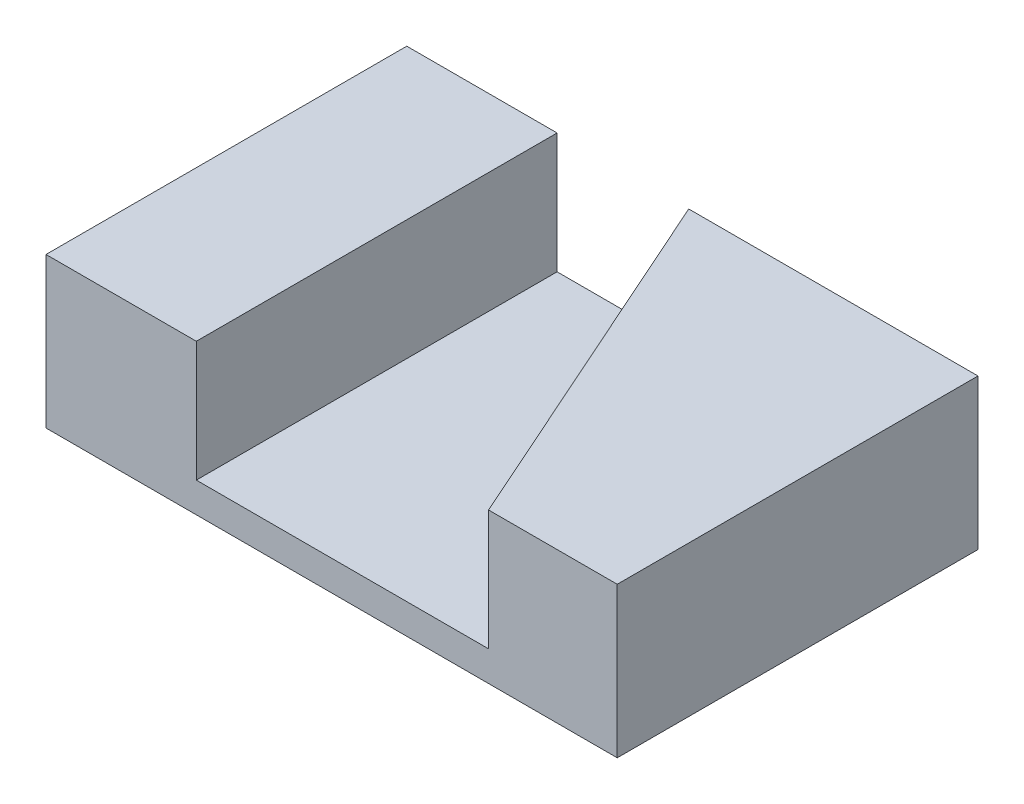
ISO-10303-21;
HEADER;
FILE_DESCRIPTION(('STEP AP214'),'2;1');
FILE_NAME('part.step','',(''),(''),'','','');
FILE_SCHEMA(('AUTOMOTIVE_DESIGN { 1 0 10303 214 1 1 1 1 }'));
ENDSEC;
DATA;
#1=APPLICATION_CONTEXT('core data for automotive mechanical design processes');
#2=APPLICATION_PROTOCOL_DEFINITION('international standard','automotive_design',2000,#1);
#3=PRODUCT_CONTEXT('',#1,'mechanical');
#4=PRODUCT('Part','Part','',(#3));
#5=PRODUCT_RELATED_PRODUCT_CATEGORY('part','',(#4));
#6=PRODUCT_DEFINITION_FORMATION('','',#4);
#7=PRODUCT_DEFINITION_CONTEXT('part definition',#1,'design');
#8=PRODUCT_DEFINITION('design','',#6,#7);
#9=PRODUCT_DEFINITION_SHAPE('','',#8);
#10=(LENGTH_UNIT() NAMED_UNIT(*) SI_UNIT(.MILLI.,.METRE.));
#11=(NAMED_UNIT(*) PLANE_ANGLE_UNIT() SI_UNIT($,.RADIAN.));
#12=(NAMED_UNIT(*) SI_UNIT($,.STERADIAN.) SOLID_ANGLE_UNIT());
#13=UNCERTAINTY_MEASURE_WITH_UNIT(LENGTH_MEASURE(1.E-05),#10,'distance_accuracy_value','');
#14=(GEOMETRIC_REPRESENTATION_CONTEXT(3) GLOBAL_UNCERTAINTY_ASSIGNED_CONTEXT((#13)) GLOBAL_UNIT_ASSIGNED_CONTEXT((#10,
#11,#12)) REPRESENTATION_CONTEXT('',''));
#15=CARTESIAN_POINT('',(0.,0.,0.));
#16=DIRECTION('',(0.,0.,1.));
#17=DIRECTION('',(1.,0.,0.));
#18=AXIS2_PLACEMENT_3D('',#15,#16,#17);
#19=CARTESIAN_POINT('',(0.,5.,-12.));
#20=DIRECTION('',(0.,-1.,0.));
#21=DIRECTION('',(0.,0.,-1.));
#22=AXIS2_PLACEMENT_3D('',#19,#20,#21);
#23=PLANE('',#22);
#24=DIRECTION('',(-1.,0.,0.));
#25=VECTOR('',#24,1.);
#26=CARTESIAN_POINT('',(0.,5.,-12.));
#27=LINE('',#26,#25);
#28=CARTESIAN_POINT('',(19.,5.,-12.));
#29=VERTEX_POINT('',#28);
#30=CARTESIAN_POINT('',(9.37854511402418,5.,-12.));
#31=VERTEX_POINT('',#30);
#32=EDGE_CURVE('E197',#29,#31,#27,.T.);
#33=ORIENTED_EDGE('',*,*,#32,.T.);
#34=DIRECTION('',(-0.406736643075795,0.,-0.913545457642603));
#35=VECTOR('',#34,1.);
#36=CARTESIAN_POINT('',(14.7212893377265,5.,0.));
#37=LINE('',#36,#35);
#38=CARTESIAN_POINT('',(14.7212893377265,5.,0.));
#39=VERTEX_POINT('',#38);
#40=EDGE_CURVE('E116',#39,#31,#37,.T.);
#41=ORIENTED_EDGE('',*,*,#40,.F.);
#42=DIRECTION('',(1.,0.,0.));
#43=VECTOR('',#42,1.);
#44=CARTESIAN_POINT('',(0.,5.,0.));
#45=LINE('',#44,#43);
#46=CARTESIAN_POINT('',(19.,5.,0.));
#47=VERTEX_POINT('',#46);
#48=EDGE_CURVE('E191',#39,#47,#45,.T.);
#49=ORIENTED_EDGE('',*,*,#48,.T.);
#50=DIRECTION('',(0.,0.,-1.));
#51=VECTOR('',#50,1.);
#52=CARTESIAN_POINT('',(19.,5.,0.));
#53=LINE('',#52,#51);
#54=EDGE_CURVE('E190',#47,#29,#53,.T.);
#55=ORIENTED_EDGE('',*,*,#54,.T.);
#56=EDGE_LOOP('',(#33,#41,#49,#55));
#57=FACE_BOUND('',#56,.T.);
#58=ADVANCED_FACE('F31',(#57),#23,.F.);
#59=CARTESIAN_POINT('',(0.,5.,0.));
#60=DIRECTION('',(1.,0.,0.));
#61=DIRECTION('',(0.,0.,-1.));
#62=AXIS2_PLACEMENT_3D('',#59,#60,#61);
#63=PLANE('',#62);
#64=DIRECTION('',(0.,0.,1.));
#65=VECTOR('',#64,1.);
#66=CARTESIAN_POINT('',(0.,0.,0.));
#67=LINE('',#66,#65);
#68=CARTESIAN_POINT('',(0.,0.,-12.));
#69=VERTEX_POINT('',#68);
#70=CARTESIAN_POINT('',(0.,0.,0.));
#71=VERTEX_POINT('',#70);
#72=EDGE_CURVE('E200',#69,#71,#67,.T.);
#73=ORIENTED_EDGE('',*,*,#72,.T.);
#74=DIRECTION('',(0.,-1.,0.));
#75=VECTOR('',#74,1.);
#76=CARTESIAN_POINT('',(0.,5.,0.));
#77=LINE('',#76,#75);
#78=CARTESIAN_POINT('',(0.,5.,0.));
#79=VERTEX_POINT('',#78);
#80=EDGE_CURVE('E39',#79,#71,#77,.T.);
#81=ORIENTED_EDGE('',*,*,#80,.F.);
#82=DIRECTION('',(0.,0.,1.));
#83=VECTOR('',#82,1.);
#84=CARTESIAN_POINT('',(0.,5.,0.));
#85=LINE('',#84,#83);
#86=CARTESIAN_POINT('',(0.,5.,-12.));
#87=VERTEX_POINT('',#86);
#88=EDGE_CURVE('E186',#87,#79,#85,.T.);
#89=ORIENTED_EDGE('',*,*,#88,.F.);
#90=DIRECTION('',(0.,-1.,0.));
#91=VECTOR('',#90,1.);
#92=CARTESIAN_POINT('',(0.,5.,-12.));
#93=LINE('',#92,#91);
#94=EDGE_CURVE('E199',#87,#69,#93,.T.);
#95=ORIENTED_EDGE('',*,*,#94,.T.);
#96=EDGE_LOOP('',(#73,#81,#89,#95));
#97=FACE_BOUND('',#96,.T.);
#98=ADVANCED_FACE('F33',(#97),#63,.F.);
#99=CARTESIAN_POINT('',(0.,5.,0.));
#100=DIRECTION('',(0.,0.,-1.));
#101=DIRECTION('',(-1.,0.,0.));
#102=AXIS2_PLACEMENT_3D('',#99,#100,#101);
#103=PLANE('',#102);
#104=ORIENTED_EDGE('',*,*,#48,.F.);
#105=DIRECTION('',(0.,1.,0.));
#106=VECTOR('',#105,1.);
#107=CARTESIAN_POINT('',(14.7212893377265,1.,0.));
#108=LINE('',#107,#106);
#109=CARTESIAN_POINT('',(14.7212893377265,1.,0.));
#110=VERTEX_POINT('',#109);
#111=EDGE_CURVE('E123',#110,#39,#108,.T.);
#112=ORIENTED_EDGE('',*,*,#111,.F.);
#113=DIRECTION('',(1.,0.,0.));
#114=VECTOR('',#113,1.);
#115=CARTESIAN_POINT('',(5.,1.,0.));
#116=LINE('',#115,#114);
#117=CARTESIAN_POINT('',(5.,1.,0.));
#118=VERTEX_POINT('',#117);
#119=EDGE_CURVE('E106',#118,#110,#116,.T.);
#120=ORIENTED_EDGE('',*,*,#119,.F.);
#121=DIRECTION('',(0.,1.,0.));
#122=VECTOR('',#121,1.);
#123=CARTESIAN_POINT('',(5.,1.,0.));
#124=LINE('',#123,#122);
#125=CARTESIAN_POINT('',(5.,5.,0.));
#126=VERTEX_POINT('',#125);
#127=EDGE_CURVE('E103',#118,#126,#124,.T.);
#128=ORIENTED_EDGE('',*,*,#127,.T.);
#129=EDGE_CURVE('E183',#79,#126,#45,.T.);
#130=ORIENTED_EDGE('',*,*,#129,.F.);
#131=ORIENTED_EDGE('',*,*,#80,.T.);
#132=DIRECTION('',(1.,0.,0.));
#133=VECTOR('',#132,1.);
#134=CARTESIAN_POINT('',(0.,0.,0.));
#135=LINE('',#134,#133);
#136=CARTESIAN_POINT('',(19.,0.,0.));
#137=VERTEX_POINT('',#136);
#138=EDGE_CURVE('E203',#71,#137,#135,.T.);
#139=ORIENTED_EDGE('',*,*,#138,.T.);
#140=DIRECTION('',(0.,-1.,0.));
#141=VECTOR('',#140,1.);
#142=CARTESIAN_POINT('',(19.,5.,0.));
#143=LINE('',#142,#141);
#144=EDGE_CURVE('E215',#47,#137,#143,.T.);
#145=ORIENTED_EDGE('',*,*,#144,.F.);
#146=EDGE_LOOP('',(#104,#112,#120,#128,#130,#131,#139,#145));
#147=FACE_BOUND('',#146,.T.);
#148=ADVANCED_FACE('F164',(#147),#103,.F.);
#149=CARTESIAN_POINT('',(19.,5.,0.));
#150=DIRECTION('',(-1.,0.,0.));
#151=DIRECTION('',(0.,0.,1.));
#152=AXIS2_PLACEMENT_3D('',#149,#150,#151);
#153=PLANE('',#152);
#154=DIRECTION('',(0.,0.,-1.));
#155=VECTOR('',#154,1.);
#156=CARTESIAN_POINT('',(19.,0.,0.));
#157=LINE('',#156,#155);
#158=CARTESIAN_POINT('',(19.,0.,-12.));
#159=VERTEX_POINT('',#158);
#160=EDGE_CURVE('E206',#137,#159,#157,.T.);
#161=ORIENTED_EDGE('',*,*,#160,.T.);
#162=DIRECTION('',(0.,-1.,0.));
#163=VECTOR('',#162,1.);
#164=CARTESIAN_POINT('',(19.,5.,-12.));
#165=LINE('',#164,#163);
#166=EDGE_CURVE('E212',#29,#159,#165,.T.);
#167=ORIENTED_EDGE('',*,*,#166,.F.);
#168=ORIENTED_EDGE('',*,*,#54,.F.);
#169=ORIENTED_EDGE('',*,*,#144,.T.);
#170=EDGE_LOOP('',(#161,#167,#168,#169));
#171=FACE_BOUND('',#170,.T.);
#172=ADVANCED_FACE('F178',(#171),#153,.F.);
#173=CARTESIAN_POINT('',(0.,5.,-12.));
#174=DIRECTION('',(0.,0.,1.));
#175=DIRECTION('',(1.,0.,0.));
#176=AXIS2_PLACEMENT_3D('',#173,#174,#175);
#177=PLANE('',#176);
#178=CARTESIAN_POINT('',(12.,3.,-12.));
#179=DIRECTION('',(0.,0.,-1.));
#180=DIRECTION('',(-1.,0.,0.));
#181=AXIS2_PLACEMENT_3D('',#178,#179,#180);
#182=CIRCLE('',#181,1.025);
#183=CARTESIAN_POINT('',(10.975,3.,-12.));
#184=VERTEX_POINT('',#183);
#185=EDGE_CURVE('E220',#184,#184,#182,.T.);
#186=ORIENTED_EDGE('',*,*,#185,.F.);
#187=EDGE_LOOP('',(#186));
#188=FACE_BOUND('',#187,.T.);
#189=DIRECTION('',(-1.,0.,0.));
#190=VECTOR('',#189,1.);
#191=CARTESIAN_POINT('',(9.37854511402418,1.,-12.));
#192=LINE('',#191,#190);
#193=CARTESIAN_POINT('',(9.37854511402418,1.,-12.));
#194=VERTEX_POINT('',#193);
#195=CARTESIAN_POINT('',(5.,1.,-12.));
#196=VERTEX_POINT('',#195);
#197=EDGE_CURVE('E107',#194,#196,#192,.T.);
#198=ORIENTED_EDGE('',*,*,#197,.F.);
#199=DIRECTION('',(0.,1.,0.));
#200=VECTOR('',#199,1.);
#201=CARTESIAN_POINT('',(9.37854511402418,1.,-12.));
#202=LINE('',#201,#200);
#203=EDGE_CURVE('E135',#194,#31,#202,.T.);
#204=ORIENTED_EDGE('',*,*,#203,.T.);
#205=ORIENTED_EDGE('',*,*,#32,.F.);
#206=ORIENTED_EDGE('',*,*,#166,.T.);
#207=DIRECTION('',(-1.,0.,0.));
#208=VECTOR('',#207,1.);
#209=CARTESIAN_POINT('',(0.,0.,-12.));
#210=LINE('',#209,#208);
#211=EDGE_CURVE('E208',#159,#69,#210,.T.);
#212=ORIENTED_EDGE('',*,*,#211,.T.);
#213=ORIENTED_EDGE('',*,*,#94,.F.);
#214=CARTESIAN_POINT('',(5.,5.,-12.));
#215=VERTEX_POINT('',#214);
#216=EDGE_CURVE('E121',#215,#87,#27,.T.);
#217=ORIENTED_EDGE('',*,*,#216,.F.);
#218=DIRECTION('',(0.,1.,0.));
#219=VECTOR('',#218,1.);
#220=CARTESIAN_POINT('',(5.,1.,-12.));
#221=LINE('',#220,#219);
#222=EDGE_CURVE('E46',#196,#215,#221,.T.);
#223=ORIENTED_EDGE('',*,*,#222,.F.);
#224=EDGE_LOOP('',(#198,#204,#205,#206,#212,#213,#217,#223));
#225=FACE_BOUND('',#224,.T.);
#226=ADVANCED_FACE('F119',(#188,#225),#177,.F.);
#227=ORIENTED_EDGE('',*,*,#129,.T.);
#228=DIRECTION('',(0.,0.,1.));
#229=VECTOR('',#228,1.);
#230=CARTESIAN_POINT('',(5.,5.,-12.));
#231=LINE('',#230,#229);
#232=EDGE_CURVE('E184',#215,#126,#231,.T.);
#233=ORIENTED_EDGE('',*,*,#232,.F.);
#234=ORIENTED_EDGE('',*,*,#216,.T.);
#235=ORIENTED_EDGE('',*,*,#88,.T.);
#236=EDGE_LOOP('',(#227,#233,#234,#235));
#237=FACE_BOUND('',#236,.T.);
#238=ADVANCED_FACE('F160',(#237),#23,.F.);
#239=CARTESIAN_POINT('',(0.,0.,-12.));
#240=DIRECTION('',(0.,-1.,0.));
#241=DIRECTION('',(0.,0.,-1.));
#242=AXIS2_PLACEMENT_3D('',#239,#240,#241);
#243=PLANE('',#242);
#244=ORIENTED_EDGE('',*,*,#72,.F.);
#245=ORIENTED_EDGE('',*,*,#211,.F.);
#246=ORIENTED_EDGE('',*,*,#160,.F.);
#247=ORIENTED_EDGE('',*,*,#138,.F.);
#248=EDGE_LOOP('',(#244,#245,#246,#247));
#249=FACE_BOUND('',#248,.T.);
#250=ADVANCED_FACE('F170',(#249),#243,.T.);
#251=CARTESIAN_POINT('',(12.,3.,-12.));
#252=DIRECTION('',(0.,0.,-1.));
#253=DIRECTION('',(-1.,0.,0.));
#254=AXIS2_PLACEMENT_3D('',#251,#252,#253);
#255=CYLINDRICAL_SURFACE('',#254,0.799999999999993);
#256=CARTESIAN_POINT('',(12.,3.,-8.15021515475689));
#257=DIRECTION('',(0.,0.,1.));
#258=DIRECTION('',(1.,0.,0.));
#259=AXIS2_PLACEMENT_3D('',#256,#257,#258);
#260=CIRCLE('',#259,0.799999999999993);
#261=CARTESIAN_POINT('',(12.8,3.,-8.15021515475689));
#262=VERTEX_POINT('',#261);
#263=EDGE_CURVE('E218',#262,#262,#260,.T.);
#264=ORIENTED_EDGE('',*,*,#263,.T.);
#265=EDGE_LOOP('',(#264));
#266=FACE_BOUND('',#265,.T.);
#267=CARTESIAN_POINT('',(12.,3.,-11.8424533039028));
#268=DIRECTION('',(0.,0.,-1.));
#269=DIRECTION('',(-1.,0.,0.));
#270=AXIS2_PLACEMENT_3D('',#267,#268,#269);
#271=CIRCLE('',#270,0.799999999999988);
#272=CARTESIAN_POINT('',(11.2,3.,-11.8424533039028));
#273=VERTEX_POINT('',#272);
#274=EDGE_CURVE('E204',#273,#273,#271,.T.);
#275=ORIENTED_EDGE('',*,*,#274,.T.);
#276=EDGE_LOOP('',(#275));
#277=FACE_BOUND('',#276,.T.);
#278=ADVANCED_FACE('F176',(#266,#277),#255,.F.);
#279=CARTESIAN_POINT('',(12.,3.,-12.));
#280=DIRECTION('',(0.,0.,-1.));
#281=DIRECTION('',(-1.,0.,0.));
#282=AXIS2_PLACEMENT_3D('',#279,#280,#281);
#283=CONICAL_SURFACE('',#282,1.025,0.959931088596931);
#284=ORIENTED_EDGE('',*,*,#274,.F.);
#285=EDGE_LOOP('',(#284));
#286=FACE_BOUND('',#285,.T.);
#287=ORIENTED_EDGE('',*,*,#185,.T.);
#288=EDGE_LOOP('',(#287));
#289=FACE_BOUND('',#288,.T.);
#290=ADVANCED_FACE('F154',(#286,#289),#283,.F.);
#291=CARTESIAN_POINT('',(12.,3.,-8.));
#292=DIRECTION('',(0.,0.,1.));
#293=DIRECTION('',(1.,0.,0.));
#294=AXIS2_PLACEMENT_3D('',#291,#292,#293);
#295=CONICAL_SURFACE('',#294,1.05,1.02974425867665);
#296=CARTESIAN_POINT('',(12.,3.,-8.));
#297=DIRECTION('',(0.,0.,1.));
#298=DIRECTION('',(1.,0.,0.));
#299=AXIS2_PLACEMENT_3D('',#296,#297,#298);
#300=CIRCLE('',#299,1.05);
#301=CARTESIAN_POINT('',(11.1594598552583,2.37072083692721,-8.));
#302=VERTEX_POINT('',#301);
#303=CARTESIAN_POINT('',(11.1594598552583,3.62927916307279,-8.));
#304=VERTEX_POINT('',#303);
#305=EDGE_CURVE('E134',#302,#304,#300,.T.);
#306=ORIENTED_EDGE('',*,*,#305,.T.);
#307=CARTESIAN_POINT('',(11.1595489009959,3.62995321918617,-7.9997999999987));
#308=CARTESIAN_POINT('',(11.1520430945614,3.57319098834756,-8.01665831726841));
#309=CARTESIAN_POINT('',(11.1452421194425,3.51578063060102,-8.03193355748384));
#310=CARTESIAN_POINT('',(11.1334457362285,3.39968176971908,-8.05842866798157));
#311=CARTESIAN_POINT('',(11.1284557110165,3.3409899970556,-8.06963644811054));
#312=CARTESIAN_POINT('',(11.1208474147552,3.22453723257684,-8.08672496130005));
#313=CARTESIAN_POINT('',(11.1181597141526,3.16680471683557,-8.09276163569071));
#314=CARTESIAN_POINT('',(11.1151677566655,3.05104449010178,-8.09948168223273));
#315=CARTESIAN_POINT('',(11.1148597993876,2.99301737786394,-8.10017336560371));
#316=CARTESIAN_POINT('',(11.1164856617467,2.88767098802925,-8.09652161895601));
#317=CARTESIAN_POINT('',(11.1180244511914,2.84031151840061,-8.09306544127588));
#318=CARTESIAN_POINT('',(11.1226043602758,2.74603072839587,-8.0827787970512));
#319=CARTESIAN_POINT('',(11.1256457503441,2.69910948843898,-8.07594772311398));
#320=CARTESIAN_POINT('',(11.1331474895191,2.60465383662679,-8.05909854105857));
#321=CARTESIAN_POINT('',(11.1376440283823,2.55713722047895,-8.0489991494167));
#322=CARTESIAN_POINT('',(11.1477896069816,2.46296094120266,-8.02621180679012));
#323=CARTESIAN_POINT('',(11.1534360691214,2.41629961153674,-8.01352964518149));
#324=CARTESIAN_POINT('',(11.1595489009954,2.37004678081819,-7.9998));
#325=B_SPLINE_CURVE_WITH_KNOTS('',3,(#307,#308,#309,#310,#311,#312,#313,#314,#315,#316,#317,
#318,#319,#320,#321,#322,#323,#324),.UNSPECIFIED.,.F.,.F.,(4,2,2,2,2,2,2,2,4),(0.,
0.179155136421957,0.358838515975772,0.532890622014881,0.706672030323571,0.849051409314863,
0.991456422194261,1.13771715848807,1.28365358470845),.UNSPECIFIED.);
#326=EDGE_CURVE('E53',#304,#302,#325,.T.);
#327=ORIENTED_EDGE('',*,*,#326,.T.);
#328=EDGE_LOOP('',(#306,#327));
#329=FACE_BOUND('',#328,.T.);
#330=ORIENTED_EDGE('',*,*,#263,.F.);
#331=EDGE_LOOP('',(#330));
#332=FACE_BOUND('',#331,.T.);
#333=ADVANCED_FACE('F137',(#329,#332),#295,.F.);
#334=CARTESIAN_POINT('',(12.,3.,0.));
#335=DIRECTION('',(0.,0.,1.));
#336=DIRECTION('',(1.,0.,0.));
#337=AXIS2_PLACEMENT_3D('',#334,#335,#336);
#338=CYLINDRICAL_SURFACE('',#337,1.05);
#339=ORIENTED_EDGE('',*,*,#305,.F.);
#340=CARTESIAN_POINT('',(12.,3.,-6.11211592496733));
#341=DIRECTION('',(0.913545457642604,0.,-0.406736643075795));
#342=DIRECTION('',(0.406736643075795,0.,0.913545457642603));
#343=AXIS2_PLACEMENT_3D('',#340,#341,#342);
#344=ELLIPSE('',#343,2.58152300235298,1.05);
#345=EDGE_CURVE('E11',#302,#304,#344,.F.);
#346=ORIENTED_EDGE('',*,*,#345,.T.);
#347=EDGE_LOOP('',(#339,#346));
#348=FACE_BOUND('',#347,.T.);
#349=ADVANCED_FACE('F146',(#348),#338,.F.);
#350=CARTESIAN_POINT('',(14.7212893377265,1.,0.));
#351=DIRECTION('',(0.913545457642604,0.,-0.406736643075795));
#352=DIRECTION('',(-0.406736643075795,0.,-0.913545457642603));
#353=AXIS2_PLACEMENT_3D('',#350,#351,#352);
#354=PLANE('',#353);
#355=ORIENTED_EDGE('',*,*,#40,.T.);
#356=ORIENTED_EDGE('',*,*,#203,.F.);
#357=DIRECTION('',(-0.406736643075795,0.,-0.913545457642603));
#358=VECTOR('',#357,1.);
#359=CARTESIAN_POINT('',(14.7212893377265,1.,0.));
#360=LINE('',#359,#358);
#361=EDGE_CURVE('E113',#110,#194,#360,.T.);
#362=ORIENTED_EDGE('',*,*,#361,.F.);
#363=ORIENTED_EDGE('',*,*,#111,.T.);
#364=EDGE_LOOP('',(#355,#356,#362,#363));
#365=FACE_BOUND('',#364,.T.);
#366=ORIENTED_EDGE('',*,*,#345,.F.);
#367=ORIENTED_EDGE('',*,*,#326,.F.);
#368=EDGE_LOOP('',(#366,#367));
#369=FACE_BOUND('',#368,.T.);
#370=ADVANCED_FACE('F141',(#365,#369),#354,.F.);
#371=CARTESIAN_POINT('',(5.,1.,-12.));
#372=DIRECTION('',(-1.,0.,0.));
#373=DIRECTION('',(0.,0.,1.));
#374=AXIS2_PLACEMENT_3D('',#371,#372,#373);
#375=PLANE('',#374);
#376=ORIENTED_EDGE('',*,*,#232,.T.);
#377=ORIENTED_EDGE('',*,*,#127,.F.);
#378=DIRECTION('',(0.,0.,1.));
#379=VECTOR('',#378,1.);
#380=CARTESIAN_POINT('',(5.,1.,-12.));
#381=LINE('',#380,#379);
#382=EDGE_CURVE('E99',#196,#118,#381,.T.);
#383=ORIENTED_EDGE('',*,*,#382,.F.);
#384=ORIENTED_EDGE('',*,*,#222,.T.);
#385=EDGE_LOOP('',(#376,#377,#383,#384));
#386=FACE_BOUND('',#385,.T.);
#387=ADVANCED_FACE('F101',(#386),#375,.F.);
#388=CARTESIAN_POINT('',(5.,1.,-12.));
#389=DIRECTION('',(0.,1.,0.));
#390=DIRECTION('',(0.,0.,1.));
#391=AXIS2_PLACEMENT_3D('',#388,#389,#390);
#392=PLANE('',#391);
#393=ORIENTED_EDGE('',*,*,#197,.T.);
#394=ORIENTED_EDGE('',*,*,#382,.T.);
#395=ORIENTED_EDGE('',*,*,#119,.T.);
#396=ORIENTED_EDGE('',*,*,#361,.T.);
#397=EDGE_LOOP('',(#393,#394,#395,#396));
#398=FACE_BOUND('',#397,.T.);
#399=ADVANCED_FACE('F111',(#398),#392,.T.);
#400=CLOSED_SHELL('',(#58,#98,#148,#172,#226,#238,#250,#278,#290,#333,#349,#370,#387,#399));
#401=MANIFOLD_SOLID_BREP('B2',#400);
#402=ADVANCED_BREP_SHAPE_REPRESENTATION('',(#18,#401),#14);
#403=SHAPE_DEFINITION_REPRESENTATION(#9,#402);
ENDSEC;
END-ISO-10303-21;
